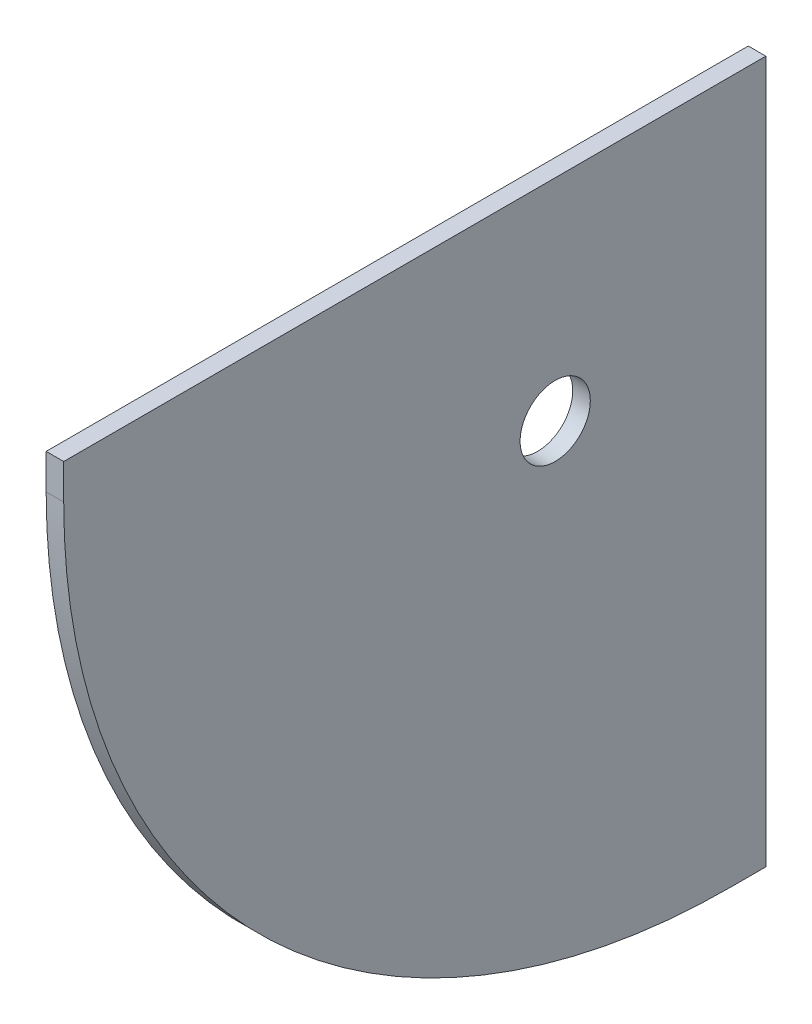
ISO-10303-21;
HEADER;
FILE_DESCRIPTION(('STEP AP214'),'2;1');
FILE_NAME('part.step','',(''),(''),'','','');
FILE_SCHEMA(('AUTOMOTIVE_DESIGN { 1 0 10303 214 1 1 1 1 }'));
ENDSEC;
DATA;
#1=APPLICATION_CONTEXT('core data for automotive mechanical design processes');
#2=APPLICATION_PROTOCOL_DEFINITION('international standard','automotive_design',2000,#1);
#3=PRODUCT_CONTEXT('',#1,'mechanical');
#4=PRODUCT('Part','Part','',(#3));
#5=PRODUCT_RELATED_PRODUCT_CATEGORY('part','',(#4));
#6=PRODUCT_DEFINITION_FORMATION('','',#4);
#7=PRODUCT_DEFINITION_CONTEXT('part definition',#1,'design');
#8=PRODUCT_DEFINITION('design','',#6,#7);
#9=PRODUCT_DEFINITION_SHAPE('','',#8);
#10=(LENGTH_UNIT() NAMED_UNIT(*) SI_UNIT(.MILLI.,.METRE.));
#11=(NAMED_UNIT(*) PLANE_ANGLE_UNIT() SI_UNIT($,.RADIAN.));
#12=(NAMED_UNIT(*) SI_UNIT($,.STERADIAN.) SOLID_ANGLE_UNIT());
#13=UNCERTAINTY_MEASURE_WITH_UNIT(LENGTH_MEASURE(1.E-05),#10,'distance_accuracy_value','');
#14=(GEOMETRIC_REPRESENTATION_CONTEXT(3) GLOBAL_UNCERTAINTY_ASSIGNED_CONTEXT((#13)) GLOBAL_UNIT_ASSIGNED_CONTEXT((#10,
#11,#12)) REPRESENTATION_CONTEXT('',''));
#15=CARTESIAN_POINT('',(0.,0.,0.));
#16=DIRECTION('',(0.,0.,1.));
#17=DIRECTION('',(1.,0.,0.));
#18=AXIS2_PLACEMENT_3D('',#15,#16,#17);
#19=CARTESIAN_POINT('',(3.175,127.,-127.));
#20=DIRECTION('',(0.,0.,1.));
#21=DIRECTION('',(1.,0.,0.));
#22=AXIS2_PLACEMENT_3D('',#19,#20,#21);
#23=PLANE('',#22);
#24=DIRECTION('',(0.,1.,0.));
#25=VECTOR('',#24,1.);
#26=CARTESIAN_POINT('',(-3.175,127.,-127.));
#27=LINE('',#26,#25);
#28=CARTESIAN_POINT('',(-3.175,-127.,-127.));
#29=VERTEX_POINT('',#28);
#30=CARTESIAN_POINT('',(-3.175,127.,-127.));
#31=VERTEX_POINT('',#30);
#32=EDGE_CURVE('E102',#29,#31,#27,.T.);
#33=ORIENTED_EDGE('',*,*,#32,.T.);
#34=DIRECTION('',(-1.,0.,0.));
#35=VECTOR('',#34,1.);
#36=CARTESIAN_POINT('',(3.175,127.,-127.));
#37=LINE('',#36,#35);
#38=CARTESIAN_POINT('',(3.175,127.,-127.));
#39=VERTEX_POINT('',#38);
#40=EDGE_CURVE('E84',#39,#31,#37,.T.);
#41=ORIENTED_EDGE('',*,*,#40,.F.);
#42=DIRECTION('',(0.,1.,0.));
#43=VECTOR('',#42,1.);
#44=CARTESIAN_POINT('',(3.175,127.,-127.));
#45=LINE('',#44,#43);
#46=CARTESIAN_POINT('',(3.175,-127.,-127.));
#47=VERTEX_POINT('',#46);
#48=EDGE_CURVE('E90',#47,#39,#45,.T.);
#49=ORIENTED_EDGE('',*,*,#48,.F.);
#50=DIRECTION('',(-1.,0.,0.));
#51=VECTOR('',#50,1.);
#52=CARTESIAN_POINT('',(3.175,-127.,-127.));
#53=LINE('',#52,#51);
#54=EDGE_CURVE('E107',#47,#29,#53,.T.);
#55=ORIENTED_EDGE('',*,*,#54,.T.);
#56=EDGE_LOOP('',(#33,#41,#49,#55));
#57=FACE_BOUND('',#56,.T.);
#58=ADVANCED_FACE('F33',(#57),#23,.F.);
#59=CARTESIAN_POINT('',(3.175,127.,127.));
#60=DIRECTION('',(0.,-1.,0.));
#61=DIRECTION('',(0.,0.,-1.));
#62=AXIS2_PLACEMENT_3D('',#59,#60,#61);
#63=PLANE('',#62);
#64=DIRECTION('',(0.,0.,1.));
#65=VECTOR('',#64,1.);
#66=CARTESIAN_POINT('',(-3.175,127.,127.));
#67=LINE('',#66,#65);
#68=CARTESIAN_POINT('',(-3.175,127.,127.));
#69=VERTEX_POINT('',#68);
#70=EDGE_CURVE('E115',#31,#69,#67,.T.);
#71=ORIENTED_EDGE('',*,*,#70,.T.);
#72=DIRECTION('',(-1.,0.,0.));
#73=VECTOR('',#72,1.);
#74=CARTESIAN_POINT('',(3.175,127.,127.));
#75=LINE('',#74,#73);
#76=CARTESIAN_POINT('',(3.175,127.,127.));
#77=VERTEX_POINT('',#76);
#78=EDGE_CURVE('E87',#77,#69,#75,.T.);
#79=ORIENTED_EDGE('',*,*,#78,.F.);
#80=DIRECTION('',(0.,0.,1.));
#81=VECTOR('',#80,1.);
#82=CARTESIAN_POINT('',(3.175,127.,127.));
#83=LINE('',#82,#81);
#84=EDGE_CURVE('E80',#39,#77,#83,.T.);
#85=ORIENTED_EDGE('',*,*,#84,.F.);
#86=ORIENTED_EDGE('',*,*,#40,.T.);
#87=EDGE_LOOP('',(#71,#79,#85,#86));
#88=FACE_BOUND('',#87,.T.);
#89=ADVANCED_FACE('F82',(#88),#63,.F.);
#90=CARTESIAN_POINT('',(3.175,127.,127.));
#91=DIRECTION('',(0.,0.,-1.));
#92=DIRECTION('',(0.,1.,0.));
#93=AXIS2_PLACEMENT_3D('',#90,#91,#92);
#94=PLANE('',#93);
#95=DIRECTION('',(0.,-1.,0.));
#96=VECTOR('',#95,1.);
#97=CARTESIAN_POINT('',(-3.175,127.,127.));
#98=LINE('',#97,#96);
#99=CARTESIAN_POINT('',(-3.175,114.3,127.));
#100=VERTEX_POINT('',#99);
#101=EDGE_CURVE('E113',#69,#100,#98,.T.);
#102=ORIENTED_EDGE('',*,*,#101,.T.);
#103=DIRECTION('',(-1.,0.,0.));
#104=VECTOR('',#103,1.);
#105=CARTESIAN_POINT('',(3.175,114.3,127.));
#106=LINE('',#105,#104);
#107=CARTESIAN_POINT('',(3.175,114.3,127.));
#108=VERTEX_POINT('',#107);
#109=EDGE_CURVE('E41',#100,#108,#106,.F.);
#110=ORIENTED_EDGE('',*,*,#109,.T.);
#111=DIRECTION('',(0.,-1.,0.));
#112=VECTOR('',#111,1.);
#113=CARTESIAN_POINT('',(3.175,127.,127.));
#114=LINE('',#113,#112);
#115=EDGE_CURVE('E89',#77,#108,#114,.T.);
#116=ORIENTED_EDGE('',*,*,#115,.F.);
#117=ORIENTED_EDGE('',*,*,#78,.T.);
#118=EDGE_LOOP('',(#102,#110,#116,#117));
#119=FACE_BOUND('',#118,.T.);
#120=ADVANCED_FACE('F140',(#119),#94,.F.);
#121=CARTESIAN_POINT('',(3.175,-127.,127.));
#122=DIRECTION('',(0.,1.,0.));
#123=DIRECTION('',(0.,0.,1.));
#124=AXIS2_PLACEMENT_3D('',#121,#122,#123);
#125=PLANE('',#124);
#126=DIRECTION('',(0.,0.,-1.));
#127=VECTOR('',#126,1.);
#128=CARTESIAN_POINT('',(3.175,-127.,127.));
#129=LINE('',#128,#127);
#130=CARTESIAN_POINT('',(3.175,-127.,-114.3));
#131=VERTEX_POINT('',#130);
#132=EDGE_CURVE('E95',#131,#47,#129,.T.);
#133=ORIENTED_EDGE('',*,*,#132,.F.);
#134=DIRECTION('',(-1.,0.,0.));
#135=VECTOR('',#134,1.);
#136=CARTESIAN_POINT('',(3.175,-127.,-114.3));
#137=LINE('',#136,#135);
#138=CARTESIAN_POINT('',(-3.175,-127.,-114.3));
#139=VERTEX_POINT('',#138);
#140=EDGE_CURVE('E103',#131,#139,#137,.T.);
#141=ORIENTED_EDGE('',*,*,#140,.T.);
#142=DIRECTION('',(0.,0.,-1.));
#143=VECTOR('',#142,1.);
#144=CARTESIAN_POINT('',(-3.175,-127.,127.));
#145=LINE('',#144,#143);
#146=EDGE_CURVE('E99',#139,#29,#145,.T.);
#147=ORIENTED_EDGE('',*,*,#146,.T.);
#148=ORIENTED_EDGE('',*,*,#54,.F.);
#149=EDGE_LOOP('',(#133,#141,#147,#148));
#150=FACE_BOUND('',#149,.T.);
#151=ADVANCED_FACE('F132',(#150),#125,.F.);
#152=CARTESIAN_POINT('',(3.175,0.,0.));
#153=DIRECTION('',(1.,0.,0.));
#154=DIRECTION('',(0.,0.,-1.));
#155=AXIS2_PLACEMENT_3D('',#152,#153,#154);
#156=PLANE('',#155);
#157=CARTESIAN_POINT('',(3.175,50.8,-50.8000000000001));
#158=DIRECTION('',(1.,0.,0.));
#159=DIRECTION('',(0.,0.,-1.));
#160=AXIS2_PLACEMENT_3D('',#157,#158,#159);
#161=CIRCLE('',#160,12.7);
#162=CARTESIAN_POINT('',(3.175,50.8,-63.5000000000001));
#163=VERTEX_POINT('',#162);
#164=EDGE_CURVE('E123',#163,#163,#161,.T.);
#165=ORIENTED_EDGE('',*,*,#164,.F.);
#166=EDGE_LOOP('',(#165));
#167=FACE_BOUND('',#166,.T.);
#168=ORIENTED_EDGE('',*,*,#115,.T.);
#169=CARTESIAN_POINT('',(3.175,114.3,-114.3));
#170=DIRECTION('',(1.,0.,0.));
#171=DIRECTION('',(0.,0.,-1.));
#172=AXIS2_PLACEMENT_3D('',#169,#170,#171);
#173=CIRCLE('',#172,241.3);
#174=EDGE_CURVE('E11',#108,#131,#173,.T.);
#175=ORIENTED_EDGE('',*,*,#174,.T.);
#176=ORIENTED_EDGE('',*,*,#132,.T.);
#177=ORIENTED_EDGE('',*,*,#48,.T.);
#178=ORIENTED_EDGE('',*,*,#84,.T.);
#179=EDGE_LOOP('',(#168,#175,#176,#177,#178));
#180=FACE_BOUND('',#179,.T.);
#181=ADVANCED_FACE('F93',(#167,#180),#156,.T.);
#182=CARTESIAN_POINT('',(-3.175,0.,0.));
#183=DIRECTION('',(1.,0.,0.));
#184=DIRECTION('',(0.,0.,-1.));
#185=AXIS2_PLACEMENT_3D('',#182,#183,#184);
#186=PLANE('',#185);
#187=CARTESIAN_POINT('',(-3.175,50.8,-50.8000000000001));
#188=DIRECTION('',(1.,0.,0.));
#189=DIRECTION('',(0.,0.,-1.));
#190=AXIS2_PLACEMENT_3D('',#187,#188,#189);
#191=CIRCLE('',#190,12.7);
#192=CARTESIAN_POINT('',(-3.175,50.8,-63.5000000000001));
#193=VERTEX_POINT('',#192);
#194=EDGE_CURVE('E118',#193,#193,#191,.F.);
#195=ORIENTED_EDGE('',*,*,#194,.F.);
#196=EDGE_LOOP('',(#195));
#197=FACE_BOUND('',#196,.T.);
#198=ORIENTED_EDGE('',*,*,#146,.F.);
#199=CARTESIAN_POINT('',(-3.175,114.3,-114.3));
#200=DIRECTION('',(1.,0.,0.));
#201=DIRECTION('',(0.,0.,-1.));
#202=AXIS2_PLACEMENT_3D('',#199,#200,#201);
#203=CIRCLE('',#202,241.3);
#204=EDGE_CURVE('E55',#139,#100,#203,.F.);
#205=ORIENTED_EDGE('',*,*,#204,.T.);
#206=ORIENTED_EDGE('',*,*,#101,.F.);
#207=ORIENTED_EDGE('',*,*,#70,.F.);
#208=ORIENTED_EDGE('',*,*,#32,.F.);
#209=EDGE_LOOP('',(#198,#205,#206,#207,#208));
#210=FACE_BOUND('',#209,.T.);
#211=ADVANCED_FACE('F131',(#197,#210),#186,.F.);
#212=CARTESIAN_POINT('',(3.175,114.3,-114.3));
#213=DIRECTION('',(-1.,0.,0.));
#214=DIRECTION('',(0.,0.,1.));
#215=AXIS2_PLACEMENT_3D('',#212,#213,#214);
#216=CYLINDRICAL_SURFACE('',#215,241.3);
#217=ORIENTED_EDGE('',*,*,#174,.F.);
#218=ORIENTED_EDGE('',*,*,#109,.F.);
#219=ORIENTED_EDGE('',*,*,#204,.F.);
#220=ORIENTED_EDGE('',*,*,#140,.F.);
#221=EDGE_LOOP('',(#217,#218,#219,#220));
#222=FACE_BOUND('',#221,.T.);
#223=ADVANCED_FACE('F35',(#222),#216,.T.);
#224=CARTESIAN_POINT('',(-3.176,50.8,-50.8000000000001));
#225=DIRECTION('',(1.,0.,0.));
#226=DIRECTION('',(0.,0.,-1.));
#227=AXIS2_PLACEMENT_3D('',#224,#225,#226);
#228=CYLINDRICAL_SURFACE('',#227,12.7);
#229=ORIENTED_EDGE('',*,*,#164,.T.);
#230=EDGE_LOOP('',(#229));
#231=FACE_BOUND('',#230,.T.);
#232=ORIENTED_EDGE('',*,*,#194,.T.);
#233=EDGE_LOOP('',(#232));
#234=FACE_BOUND('',#233,.T.);
#235=ADVANCED_FACE('F127',(#231,#234),#228,.F.);
#236=CLOSED_SHELL('',(#58,#89,#120,#151,#181,#211,#223,#235));
#237=MANIFOLD_SOLID_BREP('B2',#236);
#238=ADVANCED_BREP_SHAPE_REPRESENTATION('',(#18,#237),#14);
#239=SHAPE_DEFINITION_REPRESENTATION(#9,#238);
ENDSEC;
END-ISO-10303-21;
